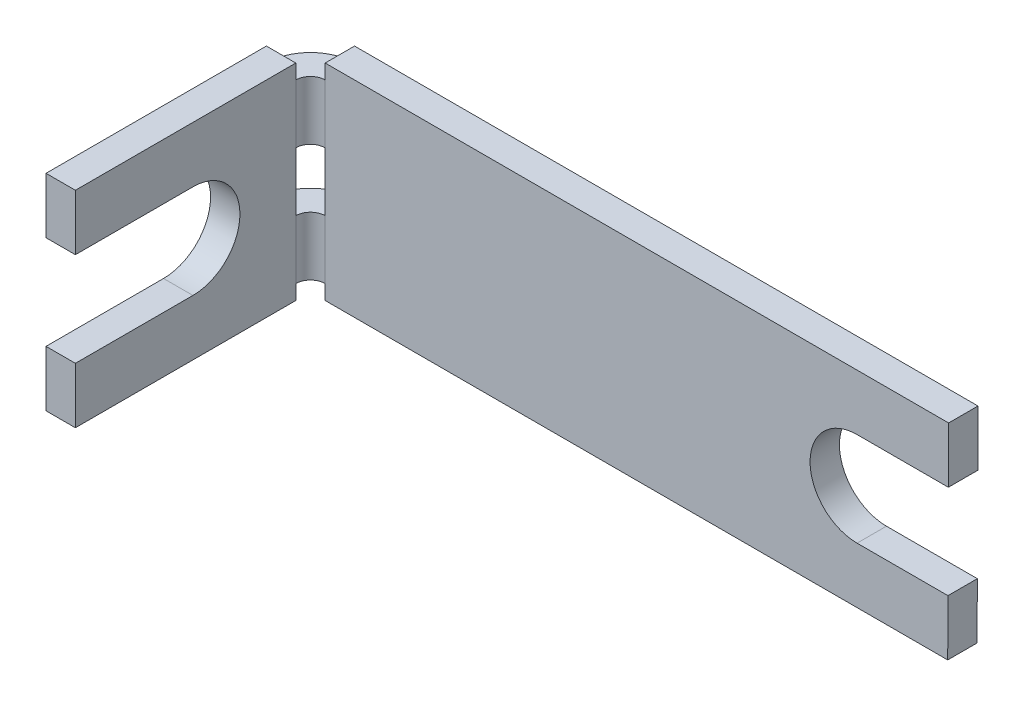
ISO-10303-21;
HEADER;
FILE_DESCRIPTION(('STEP AP214'),'2;1');
FILE_NAME('part.step','',(''),(''),'','','');
FILE_SCHEMA(('AUTOMOTIVE_DESIGN { 1 0 10303 214 1 1 1 1 }'));
ENDSEC;
DATA;
#1=APPLICATION_CONTEXT('core data for automotive mechanical design processes');
#2=APPLICATION_PROTOCOL_DEFINITION('international standard','automotive_design',2000,#1);
#3=PRODUCT_CONTEXT('',#1,'mechanical');
#4=PRODUCT('Part','Part','',(#3));
#5=PRODUCT_RELATED_PRODUCT_CATEGORY('part','',(#4));
#6=PRODUCT_DEFINITION_FORMATION('','',#4);
#7=PRODUCT_DEFINITION_CONTEXT('part definition',#1,'design');
#8=PRODUCT_DEFINITION('design','',#6,#7);
#9=PRODUCT_DEFINITION_SHAPE('','',#8);
#10=(LENGTH_UNIT() NAMED_UNIT(*) SI_UNIT(.MILLI.,.METRE.));
#11=(NAMED_UNIT(*) PLANE_ANGLE_UNIT() SI_UNIT($,.RADIAN.));
#12=(NAMED_UNIT(*) SI_UNIT($,.STERADIAN.) SOLID_ANGLE_UNIT());
#13=UNCERTAINTY_MEASURE_WITH_UNIT(LENGTH_MEASURE(1.E-05),#10,'distance_accuracy_value','');
#14=(GEOMETRIC_REPRESENTATION_CONTEXT(3) GLOBAL_UNCERTAINTY_ASSIGNED_CONTEXT((#13)) GLOBAL_UNIT_ASSIGNED_CONTEXT((#10,
#11,#12)) REPRESENTATION_CONTEXT('',''));
#15=CARTESIAN_POINT('',(0.,0.,0.));
#16=DIRECTION('',(0.,0.,1.));
#17=DIRECTION('',(1.,0.,0.));
#18=AXIS2_PLACEMENT_3D('',#15,#16,#17);
#19=CARTESIAN_POINT('',(-5.39958716632695,-2.47735966736105,0.5));
#20=DIRECTION('',(0.,-1.,0.));
#21=DIRECTION('',(-1.,0.,0.));
#22=AXIS2_PLACEMENT_3D('',#19,#20,#21);
#23=CYLINDRICAL_SURFACE('',#22,1.5);
#24=DIRECTION('',(0.,-1.,0.));
#25=VECTOR('',#24,1.);
#26=CARTESIAN_POINT('',(-5.39958716632695,-2.47735966736105,-1.));
#27=LINE('',#26,#25);
#28=CARTESIAN_POINT('',(-5.39958716632695,-1.97735966736105,-1.));
#29=VERTEX_POINT('',#28);
#30=CARTESIAN_POINT('',(-5.39958716632695,0.0226403326403329,-1.));
#31=VERTEX_POINT('',#30);
#32=EDGE_CURVE('E241',#29,#31,#27,.F.);
#33=ORIENTED_EDGE('',*,*,#32,.F.);
#34=CARTESIAN_POINT('',(-5.39958716632695,-1.97735966736105,0.5));
#35=DIRECTION('',(0.,-1.,0.));
#36=DIRECTION('',(0.,0.,-1.));
#37=AXIS2_PLACEMENT_3D('',#34,#35,#36);
#38=CIRCLE('',#37,1.5);
#39=CARTESIAN_POINT('',(-6.89958716632695,-1.97735966736105,0.499999999999995));
#40=VERTEX_POINT('',#39);
#41=EDGE_CURVE('E335',#29,#40,#38,.F.);
#42=ORIENTED_EDGE('',*,*,#41,.T.);
#43=DIRECTION('',(0.,1.,0.));
#44=VECTOR('',#43,1.);
#45=CARTESIAN_POINT('',(-6.89958716632695,0.,0.499999999999995));
#46=LINE('',#45,#44);
#47=CARTESIAN_POINT('',(-6.89958716632695,0.0226403326403328,0.499999999999995));
#48=VERTEX_POINT('',#47);
#49=EDGE_CURVE('E65',#40,#48,#46,.T.);
#50=ORIENTED_EDGE('',*,*,#49,.T.);
#51=CARTESIAN_POINT('',(-5.39958716632695,0.0226403326403332,0.5));
#52=DIRECTION('',(0.,-1.,0.));
#53=DIRECTION('',(1.,0.,0.));
#54=AXIS2_PLACEMENT_3D('',#51,#52,#53);
#55=CIRCLE('',#54,1.5);
#56=EDGE_CURVE('E418',#31,#48,#55,.F.);
#57=ORIENTED_EDGE('',*,*,#56,.F.);
#58=EDGE_LOOP('',(#33,#42,#50,#57));
#59=FACE_BOUND('',#58,.T.);
#60=ADVANCED_FACE('F42',(#59),#23,.T.);
#61=CARTESIAN_POINT('',(-5.39958716632695,-2.47735966736105,0.5));
#62=DIRECTION('',(0.,-1.,0.));
#63=DIRECTION('',(-1.,0.,0.));
#64=AXIS2_PLACEMENT_3D('',#61,#62,#63);
#65=CYLINDRICAL_SURFACE('',#64,0.500000000000001);
#66=CARTESIAN_POINT('',(-5.39958716632695,-1.97735966736105,0.5));
#67=DIRECTION('',(0.,-1.,0.));
#68=DIRECTION('',(0.,0.,-1.));
#69=AXIS2_PLACEMENT_3D('',#66,#67,#68);
#70=CIRCLE('',#69,0.500000000000001);
#71=CARTESIAN_POINT('',(-5.39958716632695,-1.97735966736105,0.));
#72=VERTEX_POINT('',#71);
#73=CARTESIAN_POINT('',(-5.89958716632695,-1.97735966736105,0.499999999999999));
#74=VERTEX_POINT('',#73);
#75=EDGE_CURVE('E50',#72,#74,#70,.F.);
#76=ORIENTED_EDGE('',*,*,#75,.F.);
#77=DIRECTION('',(0.,-1.,0.));
#78=VECTOR('',#77,1.);
#79=CARTESIAN_POINT('',(-5.39958716632695,-2.47735966736105,0.));
#80=LINE('',#79,#78);
#81=CARTESIAN_POINT('',(-5.39958716632695,0.0226403326403331,0.));
#82=VERTEX_POINT('',#81);
#83=EDGE_CURVE('E245',#72,#82,#80,.F.);
#84=ORIENTED_EDGE('',*,*,#83,.T.);
#85=CARTESIAN_POINT('',(-5.39958716632695,0.0226403326403332,0.5));
#86=DIRECTION('',(0.,-1.,0.));
#87=DIRECTION('',(1.,0.,0.));
#88=AXIS2_PLACEMENT_3D('',#85,#86,#87);
#89=CIRCLE('',#88,0.500000000000001);
#90=CARTESIAN_POINT('',(-5.89958716632695,0.022640332640333,0.499999999999999));
#91=VERTEX_POINT('',#90);
#92=EDGE_CURVE('E297',#82,#91,#89,.F.);
#93=ORIENTED_EDGE('',*,*,#92,.T.);
#94=DIRECTION('',(0.,-1.,0.));
#95=VECTOR('',#94,1.);
#96=CARTESIAN_POINT('',(-5.89958716632695,4.52264033263894,0.499999999999999));
#97=LINE('',#96,#95);
#98=EDGE_CURVE('E331',#91,#74,#97,.T.);
#99=ORIENTED_EDGE('',*,*,#98,.T.);
#100=EDGE_LOOP('',(#76,#84,#93,#99));
#101=FACE_BOUND('',#100,.T.);
#102=ADVANCED_FACE('F337',(#101),#65,.F.);
#103=CARTESIAN_POINT('',(-5.39958716632695,4.02264033263894,0.5));
#104=DIRECTION('',(0.,-1.,0.));
#105=DIRECTION('',(0.,0.,-1.));
#106=AXIS2_PLACEMENT_3D('',#103,#104,#105);
#107=CIRCLE('',#106,1.5);
#108=CARTESIAN_POINT('',(-5.39958716632695,4.02264033263894,-1.));
#109=VERTEX_POINT('',#108);
#110=CARTESIAN_POINT('',(-6.89958716632695,4.02264033263894,0.499999999999995));
#111=VERTEX_POINT('',#110);
#112=EDGE_CURVE('E209',#109,#111,#107,.F.);
#113=ORIENTED_EDGE('',*,*,#112,.F.);
#114=CARTESIAN_POINT('',(-5.39958716632695,2.02264033263756,-1.));
#115=VERTEX_POINT('',#114);
#116=EDGE_CURVE('E231',#115,#109,#27,.F.);
#117=ORIENTED_EDGE('',*,*,#116,.F.);
#118=CARTESIAN_POINT('',(-5.39958716632695,2.02264033263756,0.5));
#119=DIRECTION('',(0.,1.,0.));
#120=DIRECTION('',(-1.,0.,0.));
#121=AXIS2_PLACEMENT_3D('',#118,#119,#120);
#122=CIRCLE('',#121,1.5);
#123=CARTESIAN_POINT('',(-6.89958716632695,2.02264033263756,0.499999999999995));
#124=VERTEX_POINT('',#123);
#125=EDGE_CURVE('E420',#124,#115,#122,.F.);
#126=ORIENTED_EDGE('',*,*,#125,.F.);
#127=EDGE_CURVE('E234',#124,#111,#46,.T.);
#128=ORIENTED_EDGE('',*,*,#127,.T.);
#129=EDGE_LOOP('',(#113,#117,#126,#128));
#130=FACE_BOUND('',#129,.T.);
#131=ADVANCED_FACE('F229',(#130),#23,.T.);
#132=CARTESIAN_POINT('',(-5.39958716632695,2.02264033263756,0.));
#133=VERTEX_POINT('',#132);
#134=CARTESIAN_POINT('',(-5.39958716632695,4.02264033263894,0.));
#135=VERTEX_POINT('',#134);
#136=EDGE_CURVE('E380',#133,#135,#80,.F.);
#137=ORIENTED_EDGE('',*,*,#136,.T.);
#138=CARTESIAN_POINT('',(-5.39958716632695,4.02264033263894,0.5));
#139=DIRECTION('',(0.,-1.,0.));
#140=DIRECTION('',(0.,0.,-1.));
#141=AXIS2_PLACEMENT_3D('',#138,#139,#140);
#142=CIRCLE('',#141,0.500000000000001);
#143=CARTESIAN_POINT('',(-5.89958716632695,4.02264033263894,0.499999999999995));
#144=VERTEX_POINT('',#143);
#145=EDGE_CURVE('E12',#135,#144,#142,.F.);
#146=ORIENTED_EDGE('',*,*,#145,.T.);
#147=CARTESIAN_POINT('',(-5.89958716632695,2.02264033263756,0.499999999999999));
#148=VERTEX_POINT('',#147);
#149=EDGE_CURVE('E342',#144,#148,#97,.T.);
#150=ORIENTED_EDGE('',*,*,#149,.T.);
#151=CARTESIAN_POINT('',(-5.39958716632695,2.02264033263756,0.5));
#152=DIRECTION('',(0.,1.,0.));
#153=DIRECTION('',(-1.,0.,0.));
#154=AXIS2_PLACEMENT_3D('',#151,#152,#153);
#155=CIRCLE('',#154,0.500000000000001);
#156=EDGE_CURVE('E312',#148,#133,#155,.F.);
#157=ORIENTED_EDGE('',*,*,#156,.T.);
#158=EDGE_LOOP('',(#137,#146,#150,#157));
#159=FACE_BOUND('',#158,.T.);
#160=ADVANCED_FACE('F474',(#159),#65,.F.);
#161=CARTESIAN_POINT('',(-6.89958716632698,4.52264033263894,8.));
#162=DIRECTION('',(0.,0.,-1.));
#163=DIRECTION('',(-1.,0.,0.));
#164=AXIS2_PLACEMENT_3D('',#161,#162,#163);
#165=PLANE('',#164);
#166=DIRECTION('',(0.,1.,0.));
#167=VECTOR('',#166,1.);
#168=CARTESIAN_POINT('',(-5.89958716632698,4.52264033263894,8.));
#169=LINE('',#168,#167);
#170=CARTESIAN_POINT('',(-5.89958716632698,-2.47735966736105,8.));
#171=VERTEX_POINT('',#170);
#172=CARTESIAN_POINT('',(-5.89958716632697,-0.577359667359668,8.));
#173=VERTEX_POINT('',#172);
#174=EDGE_CURVE('E364',#171,#173,#169,.T.);
#175=ORIENTED_EDGE('',*,*,#174,.T.);
#176=DIRECTION('',(-1.,0.,0.));
#177=VECTOR('',#176,1.);
#178=CARTESIAN_POINT('',(0.550219032309287,-0.577359667359668,8.00000000000003));
#179=LINE('',#178,#177);
#180=CARTESIAN_POINT('',(-6.89958716632698,-0.577359667359668,8.));
#181=VERTEX_POINT('',#180);
#182=EDGE_CURVE('E433',#173,#181,#179,.T.);
#183=ORIENTED_EDGE('',*,*,#182,.T.);
#184=DIRECTION('',(0.,1.,0.));
#185=VECTOR('',#184,1.);
#186=CARTESIAN_POINT('',(-6.89958716632698,4.52264033263894,8.));
#187=LINE('',#186,#185);
#188=CARTESIAN_POINT('',(-6.89958716632698,-2.47735966736105,8.));
#189=VERTEX_POINT('',#188);
#190=EDGE_CURVE('E367',#189,#181,#187,.T.);
#191=ORIENTED_EDGE('',*,*,#190,.F.);
#192=DIRECTION('',(1.,0.,0.));
#193=VECTOR('',#192,1.);
#194=CARTESIAN_POINT('',(-6.89958716632698,-2.47735966736105,8.));
#195=LINE('',#194,#193);
#196=EDGE_CURVE('E378',#189,#171,#195,.T.);
#197=ORIENTED_EDGE('',*,*,#196,.T.);
#198=EDGE_LOOP('',(#175,#183,#191,#197));
#199=FACE_BOUND('',#198,.T.);
#200=ADVANCED_FACE('F457',(#199),#165,.F.);
#201=CARTESIAN_POINT('',(-5.89958716632695,-2.47735966736105,-1.));
#202=DIRECTION('',(0.,-1.,0.));
#203=DIRECTION('',(1.,0.,0.));
#204=AXIS2_PLACEMENT_3D('',#201,#202,#203);
#205=PLANE('',#204);
#206=DIRECTION('',(1.,0.,0.));
#207=VECTOR('',#206,1.);
#208=CARTESIAN_POINT('',(-5.89958716632695,-2.47735966736105,0.));
#209=LINE('',#208,#207);
#210=CARTESIAN_POINT('',(-5.39958716632695,-2.47735966736105,0.));
#211=VERTEX_POINT('',#210);
#212=CARTESIAN_POINT('',(15.7849810224966,-2.47735966736105,0.));
#213=VERTEX_POINT('',#212);
#214=EDGE_CURVE('E279',#211,#213,#209,.T.);
#215=ORIENTED_EDGE('',*,*,#214,.F.);
#216=DIRECTION('',(0.,0.,-1.));
#217=VECTOR('',#216,1.);
#218=CARTESIAN_POINT('',(-5.39958716632695,-2.47735966736105,0.));
#219=LINE('',#218,#217);
#220=CARTESIAN_POINT('',(-5.39958716632695,-2.47735966736105,-1.));
#221=VERTEX_POINT('',#220);
#222=EDGE_CURVE('E249',#211,#221,#219,.T.);
#223=ORIENTED_EDGE('',*,*,#222,.T.);
#224=DIRECTION('',(1.,0.,0.));
#225=VECTOR('',#224,1.);
#226=CARTESIAN_POINT('',(-5.89958716632695,-2.47735966736105,-1.));
#227=LINE('',#226,#225);
#228=CARTESIAN_POINT('',(15.7849810224966,-2.47735966736105,-1.));
#229=VERTEX_POINT('',#228);
#230=EDGE_CURVE('E260',#221,#229,#227,.T.);
#231=ORIENTED_EDGE('',*,*,#230,.T.);
#232=DIRECTION('',(0.,0.,1.));
#233=VECTOR('',#232,1.);
#234=CARTESIAN_POINT('',(15.7849810224966,-2.47735966736105,-1.));
#235=LINE('',#234,#233);
#236=EDGE_CURVE('E276',#229,#213,#235,.T.);
#237=ORIENTED_EDGE('',*,*,#236,.T.);
#238=EDGE_LOOP('',(#215,#223,#231,#237));
#239=FACE_BOUND('',#238,.T.);
#240=ADVANCED_FACE('F504',(#239),#205,.T.);
#241=CARTESIAN_POINT('',(12.700412833673,1.02264033263855,-1.));
#242=DIRECTION('',(0.,0.,1.));
#243=DIRECTION('',(1.,0.,0.));
#244=AXIS2_PLACEMENT_3D('',#241,#242,#243);
#245=PLANE('',#244);
#246=EDGE_CURVE('E244',#221,#29,#27,.F.);
#247=ORIENTED_EDGE('',*,*,#246,.T.);
#248=ORIENTED_EDGE('',*,*,#32,.T.);
#249=DIRECTION('',(0.,-1.,0.));
#250=VECTOR('',#249,1.);
#251=CARTESIAN_POINT('',(-5.39958716632695,-2.47735966736105,-1.));
#252=LINE('',#251,#250);
#253=EDGE_CURVE('E240',#115,#31,#252,.T.);
#254=ORIENTED_EDGE('',*,*,#253,.F.);
#255=ORIENTED_EDGE('',*,*,#116,.T.);
#256=DIRECTION('',(0.,1.,0.));
#257=VECTOR('',#256,1.);
#258=CARTESIAN_POINT('',(-5.39958716632695,4.02264033263894,-1.));
#259=LINE('',#258,#257);
#260=CARTESIAN_POINT('',(-5.39958716632695,4.52264033263894,-1.));
#261=VERTEX_POINT('',#260);
#262=EDGE_CURVE('E213',#109,#261,#259,.T.);
#263=ORIENTED_EDGE('',*,*,#262,.T.);
#264=DIRECTION('',(-1.,0.,0.));
#265=VECTOR('',#264,1.);
#266=CARTESIAN_POINT('',(15.815868594768,4.52264033263895,-1.));
#267=LINE('',#266,#265);
#268=CARTESIAN_POINT('',(15.815868594768,4.52264033263895,-1.));
#269=VERTEX_POINT('',#268);
#270=EDGE_CURVE('E258',#269,#261,#267,.T.);
#271=ORIENTED_EDGE('',*,*,#270,.F.);
#272=DIRECTION('',(0.00441246736877614,0.999990265018475,0.));
#273=VECTOR('',#272,1.);
#274=CARTESIAN_POINT('',(15.8074848251515,2.62264033263815,-1.));
#275=LINE('',#274,#273);
#276=CARTESIAN_POINT('',(15.8074848251515,2.62264033263815,-1.));
#277=VERTEX_POINT('',#276);
#278=EDGE_CURVE('E273',#277,#269,#275,.T.);
#279=ORIENTED_EDGE('',*,*,#278,.F.);
#280=DIRECTION('',(1.,0.,0.));
#281=VECTOR('',#280,1.);
#282=CARTESIAN_POINT('',(13.620412833673,2.62264033263815,-1.));
#283=LINE('',#282,#281);
#284=CARTESIAN_POINT('',(12.700412833673,2.62264033263815,-1.));
#285=VERTEX_POINT('',#284);
#286=EDGE_CURVE('E271',#285,#277,#283,.T.);
#287=ORIENTED_EDGE('',*,*,#286,.F.);
#288=CARTESIAN_POINT('',(12.700412833673,1.02264033263855,-1.));
#289=DIRECTION('',(0.,0.,-1.));
#290=DIRECTION('',(1.,0.,0.));
#291=AXIS2_PLACEMENT_3D('',#288,#289,#290);
#292=CIRCLE('',#291,1.5999999999996);
#293=CARTESIAN_POINT('',(12.700412833673,-0.577359667361056,-1.));
#294=VERTEX_POINT('',#293);
#295=EDGE_CURVE('E268',#294,#285,#292,.T.);
#296=ORIENTED_EDGE('',*,*,#295,.F.);
#297=DIRECTION('',(-1.,0.,0.));
#298=VECTOR('',#297,1.);
#299=CARTESIAN_POINT('',(13.620412833673,-0.577359667361056,-1.));
#300=LINE('',#299,#298);
#301=CARTESIAN_POINT('',(15.7933647921131,-0.577359667361056,-1.));
#302=VERTEX_POINT('',#301);
#303=EDGE_CURVE('E266',#302,#294,#300,.T.);
#304=ORIENTED_EDGE('',*,*,#303,.F.);
#305=DIRECTION('',(0.00441246736877982,0.999990265018475,0.));
#306=VECTOR('',#305,1.);
#307=CARTESIAN_POINT('',(15.7849810224966,-2.47735966736105,-1.));
#308=LINE('',#307,#306);
#309=EDGE_CURVE('E263',#229,#302,#308,.T.);
#310=ORIENTED_EDGE('',*,*,#309,.F.);
#311=ORIENTED_EDGE('',*,*,#230,.F.);
#312=EDGE_LOOP('',(#247,#248,#254,#255,#263,#271,#279,#287,#296,#304,#310,#311));
#313=FACE_BOUND('',#312,.T.);
#314=ADVANCED_FACE('F238',(#313),#245,.F.);
#315=CARTESIAN_POINT('',(12.700412833673,1.02264033263855,0.));
#316=DIRECTION('',(0.,0.,1.));
#317=DIRECTION('',(1.,0.,0.));
#318=AXIS2_PLACEMENT_3D('',#315,#316,#317);
#319=PLANE('',#318);
#320=DIRECTION('',(-1.,0.,0.));
#321=VECTOR('',#320,1.);
#322=CARTESIAN_POINT('',(15.815868594768,4.52264033263895,0.));
#323=LINE('',#322,#321);
#324=CARTESIAN_POINT('',(15.815868594768,4.52264033263895,0.));
#325=VERTEX_POINT('',#324);
#326=CARTESIAN_POINT('',(-5.39958716632695,4.52264033263894,0.));
#327=VERTEX_POINT('',#326);
#328=EDGE_CURVE('E255',#325,#327,#323,.T.);
#329=ORIENTED_EDGE('',*,*,#328,.T.);
#330=DIRECTION('',(0.,1.,0.));
#331=VECTOR('',#330,1.);
#332=CARTESIAN_POINT('',(-5.39958716632695,1.02264033263855,0.));
#333=LINE('',#332,#331);
#334=EDGE_CURVE('E235',#135,#327,#333,.T.);
#335=ORIENTED_EDGE('',*,*,#334,.F.);
#336=ORIENTED_EDGE('',*,*,#136,.F.);
#337=EDGE_CURVE('E247',#82,#133,#80,.F.);
#338=ORIENTED_EDGE('',*,*,#337,.F.);
#339=ORIENTED_EDGE('',*,*,#83,.F.);
#340=EDGE_CURVE('E242',#211,#72,#80,.F.);
#341=ORIENTED_EDGE('',*,*,#340,.F.);
#342=ORIENTED_EDGE('',*,*,#214,.T.);
#343=DIRECTION('',(0.00441246736877982,0.999990265018475,0.));
#344=VECTOR('',#343,1.);
#345=CARTESIAN_POINT('',(15.7849810224966,-2.47735966736105,0.));
#346=LINE('',#345,#344);
#347=CARTESIAN_POINT('',(15.7933647921131,-0.577359667361056,0.));
#348=VERTEX_POINT('',#347);
#349=EDGE_CURVE('E281',#213,#348,#346,.T.);
#350=ORIENTED_EDGE('',*,*,#349,.T.);
#351=DIRECTION('',(-1.,0.,0.));
#352=VECTOR('',#351,1.);
#353=CARTESIAN_POINT('',(13.620412833673,-0.577359667361056,0.));
#354=LINE('',#353,#352);
#355=CARTESIAN_POINT('',(12.700412833673,-0.577359667361056,0.));
#356=VERTEX_POINT('',#355);
#357=EDGE_CURVE('E284',#348,#356,#354,.T.);
#358=ORIENTED_EDGE('',*,*,#357,.T.);
#359=CARTESIAN_POINT('',(12.700412833673,1.02264033263855,0.));
#360=DIRECTION('',(0.,0.,-1.));
#361=DIRECTION('',(1.,0.,0.));
#362=AXIS2_PLACEMENT_3D('',#359,#360,#361);
#363=CIRCLE('',#362,1.5999999999996);
#364=CARTESIAN_POINT('',(12.700412833673,2.62264033263815,0.));
#365=VERTEX_POINT('',#364);
#366=EDGE_CURVE('E287',#356,#365,#363,.T.);
#367=ORIENTED_EDGE('',*,*,#366,.T.);
#368=DIRECTION('',(1.,0.,0.));
#369=VECTOR('',#368,1.);
#370=CARTESIAN_POINT('',(13.620412833673,2.62264033263815,0.));
#371=LINE('',#370,#369);
#372=CARTESIAN_POINT('',(15.8074848251515,2.62264033263815,0.));
#373=VERTEX_POINT('',#372);
#374=EDGE_CURVE('E290',#365,#373,#371,.T.);
#375=ORIENTED_EDGE('',*,*,#374,.T.);
#376=DIRECTION('',(0.00441246736877614,0.999990265018475,0.));
#377=VECTOR('',#376,1.);
#378=CARTESIAN_POINT('',(15.8074848251515,2.62264033263815,0.));
#379=LINE('',#378,#377);
#380=EDGE_CURVE('E261',#373,#325,#379,.T.);
#381=ORIENTED_EDGE('',*,*,#380,.T.);
#382=EDGE_LOOP('',(#329,#335,#336,#338,#339,#341,#342,#350,#358,#367,#375,#381));
#383=FACE_BOUND('',#382,.T.);
#384=ADVANCED_FACE('F403',(#383),#319,.T.);
#385=CARTESIAN_POINT('',(15.815868594768,4.52264033263895,-1.));
#386=DIRECTION('',(0.,1.,0.));
#387=DIRECTION('',(-1.,0.,0.));
#388=AXIS2_PLACEMENT_3D('',#385,#386,#387);
#389=PLANE('',#388);
#390=DIRECTION('',(0.,0.,-1.));
#391=VECTOR('',#390,1.);
#392=CARTESIAN_POINT('',(-5.39958716632695,4.52264033263894,0.));
#393=LINE('',#392,#391);
#394=EDGE_CURVE('E219',#327,#261,#393,.T.);
#395=ORIENTED_EDGE('',*,*,#394,.F.);
#396=ORIENTED_EDGE('',*,*,#328,.F.);
#397=DIRECTION('',(0.,0.,1.));
#398=VECTOR('',#397,1.);
#399=CARTESIAN_POINT('',(15.815868594768,4.52264033263895,-1.));
#400=LINE('',#399,#398);
#401=EDGE_CURVE('E295',#269,#325,#400,.T.);
#402=ORIENTED_EDGE('',*,*,#401,.F.);
#403=ORIENTED_EDGE('',*,*,#270,.T.);
#404=EDGE_LOOP('',(#395,#396,#402,#403));
#405=FACE_BOUND('',#404,.T.);
#406=ADVANCED_FACE('F44',(#405),#389,.T.);
#407=CARTESIAN_POINT('',(15.8074848251515,2.62264033263815,-1.));
#408=DIRECTION('',(0.999990265018475,-0.00441246736877614,0.));
#409=DIRECTION('',(0.00441246736877614,0.999990265018475,0.));
#410=AXIS2_PLACEMENT_3D('',#407,#408,#409);
#411=PLANE('',#410);
#412=ORIENTED_EDGE('',*,*,#380,.F.);
#413=DIRECTION('',(0.,0.,1.));
#414=VECTOR('',#413,1.);
#415=CARTESIAN_POINT('',(15.8074848251515,2.62264033263815,-1.));
#416=LINE('',#415,#414);
#417=EDGE_CURVE('E298',#277,#373,#416,.T.);
#418=ORIENTED_EDGE('',*,*,#417,.F.);
#419=ORIENTED_EDGE('',*,*,#278,.T.);
#420=ORIENTED_EDGE('',*,*,#401,.T.);
#421=EDGE_LOOP('',(#412,#418,#419,#420));
#422=FACE_BOUND('',#421,.T.);
#423=ADVANCED_FACE('F511',(#422),#411,.T.);
#424=CARTESIAN_POINT('',(13.620412833673,2.62264033263815,-1.));
#425=DIRECTION('',(0.,-1.,0.));
#426=DIRECTION('',(0.,0.,-1.));
#427=AXIS2_PLACEMENT_3D('',#424,#425,#426);
#428=PLANE('',#427);
#429=ORIENTED_EDGE('',*,*,#374,.F.);
#430=DIRECTION('',(0.,0.,1.));
#431=VECTOR('',#430,1.);
#432=CARTESIAN_POINT('',(12.700412833673,2.62264033263815,-1.));
#433=LINE('',#432,#431);
#434=EDGE_CURVE('E300',#285,#365,#433,.T.);
#435=ORIENTED_EDGE('',*,*,#434,.F.);
#436=ORIENTED_EDGE('',*,*,#286,.T.);
#437=ORIENTED_EDGE('',*,*,#417,.T.);
#438=EDGE_LOOP('',(#429,#435,#436,#437));
#439=FACE_BOUND('',#438,.T.);
#440=ADVANCED_FACE('F514',(#439),#428,.T.);
#441=CARTESIAN_POINT('',(12.700412833673,1.02264033263855,-1.));
#442=DIRECTION('',(0.,0.,1.));
#443=DIRECTION('',(1.,0.,0.));
#444=AXIS2_PLACEMENT_3D('',#441,#442,#443);
#445=CYLINDRICAL_SURFACE('',#444,1.5999999999996);
#446=ORIENTED_EDGE('',*,*,#366,.F.);
#447=DIRECTION('',(0.,0.,1.));
#448=VECTOR('',#447,1.);
#449=CARTESIAN_POINT('',(12.700412833673,-0.577359667361056,-1.));
#450=LINE('',#449,#448);
#451=EDGE_CURVE('E303',#294,#356,#450,.T.);
#452=ORIENTED_EDGE('',*,*,#451,.F.);
#453=ORIENTED_EDGE('',*,*,#295,.T.);
#454=ORIENTED_EDGE('',*,*,#434,.T.);
#455=EDGE_LOOP('',(#446,#452,#453,#454));
#456=FACE_BOUND('',#455,.T.);
#457=ADVANCED_FACE('F518',(#456),#445,.F.);
#458=CARTESIAN_POINT('',(13.620412833673,-0.577359667361056,-1.));
#459=DIRECTION('',(0.,1.,0.));
#460=DIRECTION('',(-1.,0.,0.));
#461=AXIS2_PLACEMENT_3D('',#458,#459,#460);
#462=PLANE('',#461);
#463=ORIENTED_EDGE('',*,*,#357,.F.);
#464=DIRECTION('',(0.,0.,1.));
#465=VECTOR('',#464,1.);
#466=CARTESIAN_POINT('',(15.7933647921131,-0.577359667361056,-1.));
#467=LINE('',#466,#465);
#468=EDGE_CURVE('E305',#302,#348,#467,.T.);
#469=ORIENTED_EDGE('',*,*,#468,.F.);
#470=ORIENTED_EDGE('',*,*,#303,.T.);
#471=ORIENTED_EDGE('',*,*,#451,.T.);
#472=EDGE_LOOP('',(#463,#469,#470,#471));
#473=FACE_BOUND('',#472,.T.);
#474=ADVANCED_FACE('F522',(#473),#462,.T.);
#475=CARTESIAN_POINT('',(15.7849810224966,-2.47735966736105,-1.));
#476=DIRECTION('',(0.999990265018475,-0.00441246736877982,0.));
#477=DIRECTION('',(0.00441246736877982,0.999990265018475,0.));
#478=AXIS2_PLACEMENT_3D('',#475,#476,#477);
#479=PLANE('',#478);
#480=ORIENTED_EDGE('',*,*,#349,.F.);
#481=ORIENTED_EDGE('',*,*,#236,.F.);
#482=ORIENTED_EDGE('',*,*,#309,.T.);
#483=ORIENTED_EDGE('',*,*,#468,.T.);
#484=EDGE_LOOP('',(#480,#481,#482,#483));
#485=FACE_BOUND('',#484,.T.);
#486=ADVANCED_FACE('F526',(#485),#479,.T.);
#487=CARTESIAN_POINT('',(-6.89958716632695,4.52264033263894,0.));
#488=DIRECTION('',(0.,-1.,0.));
#489=DIRECTION('',(1.,0.,0.));
#490=AXIS2_PLACEMENT_3D('',#487,#488,#489);
#491=PLANE('',#490);
#492=DIRECTION('',(-1.,0.,0.));
#493=VECTOR('',#492,1.);
#494=CARTESIAN_POINT('',(-5.89958716632695,4.52264033263894,0.499999999999999));
#495=LINE('',#494,#493);
#496=CARTESIAN_POINT('',(-5.89958716632695,4.52264033263894,0.499999999999999));
#497=VERTEX_POINT('',#496);
#498=CARTESIAN_POINT('',(-6.89958716632695,4.52264033263894,0.499999999999995));
#499=VERTEX_POINT('',#498);
#500=EDGE_CURVE('E340',#497,#499,#495,.T.);
#501=ORIENTED_EDGE('',*,*,#500,.T.);
#502=DIRECTION('',(0.,0.,-1.));
#503=VECTOR('',#502,1.);
#504=CARTESIAN_POINT('',(-6.89958716632695,4.52264033263894,0.));
#505=LINE('',#504,#503);
#506=CARTESIAN_POINT('',(-6.89958716632698,4.52264033263894,8.));
#507=VERTEX_POINT('',#506);
#508=EDGE_CURVE('E360',#507,#499,#505,.T.);
#509=ORIENTED_EDGE('',*,*,#508,.F.);
#510=DIRECTION('',(1.,0.,0.));
#511=VECTOR('',#510,1.);
#512=CARTESIAN_POINT('',(-6.89958716632698,4.52264033263894,8.));
#513=LINE('',#512,#511);
#514=CARTESIAN_POINT('',(-5.89958716632698,4.52264033263894,8.));
#515=VERTEX_POINT('',#514);
#516=EDGE_CURVE('E370',#507,#515,#513,.T.);
#517=ORIENTED_EDGE('',*,*,#516,.T.);
#518=DIRECTION('',(0.,0.,-1.));
#519=VECTOR('',#518,1.);
#520=CARTESIAN_POINT('',(-5.89958716632695,4.52264033263894,0.));
#521=LINE('',#520,#519);
#522=EDGE_CURVE('E359',#515,#497,#521,.T.);
#523=ORIENTED_EDGE('',*,*,#522,.T.);
#524=EDGE_LOOP('',(#501,#509,#517,#523));
#525=FACE_BOUND('',#524,.T.);
#526=ADVANCED_FACE('F469',(#525),#491,.F.);
#527=CARTESIAN_POINT('',(-6.89958716632698,-2.47735966736105,8.));
#528=DIRECTION('',(0.,1.,0.));
#529=DIRECTION('',(-1.,0.,0.));
#530=AXIS2_PLACEMENT_3D('',#527,#528,#529);
#531=PLANE('',#530);
#532=DIRECTION('',(-1.,0.,0.));
#533=VECTOR('',#532,1.);
#534=CARTESIAN_POINT('',(-5.89958716632695,-2.47735966736105,0.499999999999999));
#535=LINE('',#534,#533);
#536=CARTESIAN_POINT('',(-5.89958716632695,-2.47735966736105,0.499999999999999));
#537=VERTEX_POINT('',#536);
#538=CARTESIAN_POINT('',(-6.89958716632695,-2.47735966736105,0.499999999999995));
#539=VERTEX_POINT('',#538);
#540=EDGE_CURVE('E352',#537,#539,#535,.T.);
#541=ORIENTED_EDGE('',*,*,#540,.F.);
#542=DIRECTION('',(0.,0.,1.));
#543=VECTOR('',#542,1.);
#544=CARTESIAN_POINT('',(-5.89958716632698,-2.47735966736105,8.));
#545=LINE('',#544,#543);
#546=EDGE_CURVE('E333',#537,#171,#545,.T.);
#547=ORIENTED_EDGE('',*,*,#546,.T.);
#548=ORIENTED_EDGE('',*,*,#196,.F.);
#549=DIRECTION('',(0.,0.,1.));
#550=VECTOR('',#549,1.);
#551=CARTESIAN_POINT('',(-6.89958716632698,-2.47735966736105,8.));
#552=LINE('',#551,#550);
#553=EDGE_CURVE('E363',#539,#189,#552,.T.);
#554=ORIENTED_EDGE('',*,*,#553,.F.);
#555=EDGE_LOOP('',(#541,#547,#548,#554));
#556=FACE_BOUND('',#555,.T.);
#557=ADVANCED_FACE('F579',(#556),#531,.F.);
#558=CARTESIAN_POINT('',(-6.89958716632695,0.,0.));
#559=DIRECTION('',(1.,0.,0.));
#560=DIRECTION('',(0.,0.,-1.));
#561=AXIS2_PLACEMENT_3D('',#558,#559,#560);
#562=PLANE('',#561);
#563=ORIENTED_EDGE('',*,*,#190,.T.);
#564=DIRECTION('',(0.,0.,1.));
#565=VECTOR('',#564,1.);
#566=CARTESIAN_POINT('',(-6.89958716632697,-0.577359667359668,4.));
#567=LINE('',#566,#565);
#568=CARTESIAN_POINT('',(-6.89958716632697,-0.577359667359668,4.));
#569=VERTEX_POINT('',#568);
#570=EDGE_CURVE('E428',#569,#181,#567,.T.);
#571=ORIENTED_EDGE('',*,*,#570,.F.);
#572=CARTESIAN_POINT('',(-6.89958716632697,1.02264033263895,4.));
#573=DIRECTION('',(-1.,0.,0.));
#574=DIRECTION('',(0.,0.,1.));
#575=AXIS2_PLACEMENT_3D('',#572,#573,#574);
#576=CIRCLE('',#575,1.59999999999861);
#577=CARTESIAN_POINT('',(-6.89958716632697,2.62264033263756,4.));
#578=VERTEX_POINT('',#577);
#579=EDGE_CURVE('E423',#578,#569,#576,.T.);
#580=ORIENTED_EDGE('',*,*,#579,.F.);
#581=DIRECTION('',(0.,0.,-1.));
#582=VECTOR('',#581,1.);
#583=CARTESIAN_POINT('',(-6.89958716632697,2.62264033263756,4.));
#584=LINE('',#583,#582);
#585=CARTESIAN_POINT('',(-6.89958716632698,2.62264033263756,8.));
#586=VERTEX_POINT('',#585);
#587=EDGE_CURVE('E424',#586,#578,#584,.T.);
#588=ORIENTED_EDGE('',*,*,#587,.F.);
#589=EDGE_CURVE('E366',#586,#507,#187,.T.);
#590=ORIENTED_EDGE('',*,*,#589,.T.);
#591=ORIENTED_EDGE('',*,*,#508,.T.);
#592=DIRECTION('',(0.,1.,0.));
#593=VECTOR('',#592,1.);
#594=CARTESIAN_POINT('',(-6.89958716632695,4.02264033263894,0.499999999999995));
#595=LINE('',#594,#593);
#596=EDGE_CURVE('E224',#111,#499,#595,.T.);
#597=ORIENTED_EDGE('',*,*,#596,.F.);
#598=ORIENTED_EDGE('',*,*,#127,.F.);
#599=DIRECTION('',(0.,1.,0.));
#600=VECTOR('',#599,1.);
#601=CARTESIAN_POINT('',(-6.89958716632695,2.02264033263756,0.499999999999995));
#602=LINE('',#601,#600);
#603=EDGE_CURVE('E411',#48,#124,#602,.T.);
#604=ORIENTED_EDGE('',*,*,#603,.F.);
#605=ORIENTED_EDGE('',*,*,#49,.F.);
#606=EDGE_CURVE('E357',#539,#40,#46,.T.);
#607=ORIENTED_EDGE('',*,*,#606,.F.);
#608=ORIENTED_EDGE('',*,*,#553,.T.);
#609=EDGE_LOOP('',(#563,#571,#580,#588,#590,#591,#597,#598,#604,#605,#607,#608));
#610=FACE_BOUND('',#609,.T.);
#611=ADVANCED_FACE('F455',(#610),#562,.F.);
#612=CARTESIAN_POINT('',(-5.89958716632695,0.,0.));
#613=DIRECTION('',(1.,0.,0.));
#614=DIRECTION('',(0.,0.,-1.));
#615=AXIS2_PLACEMENT_3D('',#612,#613,#614);
#616=PLANE('',#615);
#617=DIRECTION('',(0.,0.,1.));
#618=VECTOR('',#617,1.);
#619=CARTESIAN_POINT('',(-5.89958716632697,-0.577359667359668,4.));
#620=LINE('',#619,#618);
#621=CARTESIAN_POINT('',(-5.89958716632697,-0.577359667359668,4.));
#622=VERTEX_POINT('',#621);
#623=EDGE_CURVE('E427',#622,#173,#620,.T.);
#624=ORIENTED_EDGE('',*,*,#623,.T.);
#625=ORIENTED_EDGE('',*,*,#174,.F.);
#626=ORIENTED_EDGE('',*,*,#546,.F.);
#627=DIRECTION('',(0.,-1.,0.));
#628=VECTOR('',#627,1.);
#629=CARTESIAN_POINT('',(-5.89958716632695,-1.97735966736105,0.499999999999999));
#630=LINE('',#629,#628);
#631=EDGE_CURVE('E327',#74,#537,#630,.T.);
#632=ORIENTED_EDGE('',*,*,#631,.F.);
#633=ORIENTED_EDGE('',*,*,#98,.F.);
#634=EDGE_CURVE('E339',#148,#91,#97,.T.);
#635=ORIENTED_EDGE('',*,*,#634,.F.);
#636=ORIENTED_EDGE('',*,*,#149,.F.);
#637=EDGE_CURVE('E343',#497,#144,#97,.T.);
#638=ORIENTED_EDGE('',*,*,#637,.F.);
#639=ORIENTED_EDGE('',*,*,#522,.F.);
#640=CARTESIAN_POINT('',(-5.89958716632698,2.62264033263756,8.));
#641=VERTEX_POINT('',#640);
#642=EDGE_CURVE('E374',#641,#515,#169,.T.);
#643=ORIENTED_EDGE('',*,*,#642,.F.);
#644=DIRECTION('',(0.,0.,-1.));
#645=VECTOR('',#644,1.);
#646=CARTESIAN_POINT('',(-5.89958716632697,2.62264033263756,4.));
#647=LINE('',#646,#645);
#648=CARTESIAN_POINT('',(-5.89958716632697,2.62264033263756,4.));
#649=VERTEX_POINT('',#648);
#650=EDGE_CURVE('E438',#641,#649,#647,.T.);
#651=ORIENTED_EDGE('',*,*,#650,.T.);
#652=CARTESIAN_POINT('',(-5.89958716632697,1.02264033263895,4.));
#653=DIRECTION('',(1.,0.,0.));
#654=DIRECTION('',(0.,0.,-1.));
#655=AXIS2_PLACEMENT_3D('',#652,#653,#654);
#656=CIRCLE('',#655,1.59999999999861);
#657=EDGE_CURVE('E434',#649,#622,#656,.F.);
#658=ORIENTED_EDGE('',*,*,#657,.T.);
#659=EDGE_LOOP('',(#624,#625,#626,#632,#633,#635,#636,#638,#639,#643,#651,#658));
#660=FACE_BOUND('',#659,.T.);
#661=ADVANCED_FACE('F329',(#660),#616,.T.);
#662=ORIENTED_EDGE('',*,*,#589,.F.);
#663=DIRECTION('',(-1.,0.,0.));
#664=VECTOR('',#663,1.);
#665=CARTESIAN_POINT('',(0.550219032309287,2.62264033263756,8.00000000000003));
#666=LINE('',#665,#664);
#667=EDGE_CURVE('E441',#641,#586,#666,.T.);
#668=ORIENTED_EDGE('',*,*,#667,.F.);
#669=ORIENTED_EDGE('',*,*,#642,.T.);
#670=ORIENTED_EDGE('',*,*,#516,.F.);
#671=EDGE_LOOP('',(#662,#668,#669,#670));
#672=FACE_BOUND('',#671,.T.);
#673=ADVANCED_FACE('F465',(#672),#165,.F.);
#674=CARTESIAN_POINT('',(0.5502190323093,-0.577359667359668,4.00000000000002));
#675=DIRECTION('',(0.,-1.,0.));
#676=DIRECTION('',(0.,0.,-1.));
#677=AXIS2_PLACEMENT_3D('',#674,#675,#676);
#678=PLANE('',#677);
#679=DIRECTION('',(-1.,0.,0.));
#680=VECTOR('',#679,1.);
#681=CARTESIAN_POINT('',(0.5502190323093,-0.577359667359668,4.00000000000002));
#682=LINE('',#681,#680);
#683=EDGE_CURVE('E345',#622,#569,#682,.T.);
#684=ORIENTED_EDGE('',*,*,#683,.T.);
#685=ORIENTED_EDGE('',*,*,#570,.T.);
#686=ORIENTED_EDGE('',*,*,#182,.F.);
#687=ORIENTED_EDGE('',*,*,#623,.F.);
#688=EDGE_LOOP('',(#684,#685,#686,#687));
#689=FACE_BOUND('',#688,.T.);
#690=ADVANCED_FACE('F447',(#689),#678,.F.);
#691=CARTESIAN_POINT('',(0.5502190323093,2.62264033263756,4.00000000000002));
#692=DIRECTION('',(0.,1.,0.));
#693=DIRECTION('',(0.,0.,1.));
#694=AXIS2_PLACEMENT_3D('',#691,#692,#693);
#695=PLANE('',#694);
#696=ORIENTED_EDGE('',*,*,#667,.T.);
#697=ORIENTED_EDGE('',*,*,#587,.T.);
#698=DIRECTION('',(-1.,0.,0.));
#699=VECTOR('',#698,1.);
#700=CARTESIAN_POINT('',(0.5502190323093,2.62264033263756,4.00000000000002));
#701=LINE('',#700,#699);
#702=EDGE_CURVE('E437',#649,#578,#701,.T.);
#703=ORIENTED_EDGE('',*,*,#702,.F.);
#704=ORIENTED_EDGE('',*,*,#650,.F.);
#705=EDGE_LOOP('',(#696,#697,#703,#704));
#706=FACE_BOUND('',#705,.T.);
#707=ADVANCED_FACE('F460',(#706),#695,.F.);
#708=CARTESIAN_POINT('',(0.5502190323093,1.02264033263895,4.00000000000002));
#709=DIRECTION('',(-1.,0.,0.));
#710=DIRECTION('',(0.,0.,1.));
#711=AXIS2_PLACEMENT_3D('',#708,#709,#710);
#712=CYLINDRICAL_SURFACE('',#711,1.59999999999861);
#713=ORIENTED_EDGE('',*,*,#702,.T.);
#714=ORIENTED_EDGE('',*,*,#579,.T.);
#715=ORIENTED_EDGE('',*,*,#683,.F.);
#716=ORIENTED_EDGE('',*,*,#657,.F.);
#717=EDGE_LOOP('',(#713,#714,#715,#716));
#718=FACE_BOUND('',#717,.T.);
#719=ADVANCED_FACE('F451',(#718),#712,.F.);
#720=CARTESIAN_POINT('',(-5.39958716632695,0.,0.));
#721=DIRECTION('',(1.,0.,0.));
#722=DIRECTION('',(0.,0.,-1.));
#723=AXIS2_PLACEMENT_3D('',#720,#721,#722);
#724=PLANE('',#723);
#725=ORIENTED_EDGE('',*,*,#253,.T.);
#726=DIRECTION('',(0.,0.,1.));
#727=VECTOR('',#726,1.);
#728=CARTESIAN_POINT('',(-5.39958716632695,0.0226403326403332,0.500000000000031));
#729=LINE('',#728,#727);
#730=EDGE_CURVE('E395',#31,#82,#729,.T.);
#731=ORIENTED_EDGE('',*,*,#730,.T.);
#732=ORIENTED_EDGE('',*,*,#337,.T.);
#733=DIRECTION('',(0.,0.,-1.));
#734=VECTOR('',#733,1.);
#735=CARTESIAN_POINT('',(-5.39958716632695,2.02264033263756,0.500000000000031));
#736=LINE('',#735,#734);
#737=EDGE_CURVE('E401',#133,#115,#736,.T.);
#738=ORIENTED_EDGE('',*,*,#737,.T.);
#739=EDGE_LOOP('',(#725,#731,#732,#738));
#740=FACE_BOUND('',#739,.T.);
#741=ADVANCED_FACE('F398',(#740),#724,.F.);
#742=CARTESIAN_POINT('',(-0.294139266701039,2.02264033263756,0.500000000000018));
#743=DIRECTION('',(0.,1.,0.));
#744=DIRECTION('',(-1.,0.,0.));
#745=AXIS2_PLACEMENT_3D('',#742,#743,#744);
#746=PLANE('',#745);
#747=ORIENTED_EDGE('',*,*,#125,.T.);
#748=ORIENTED_EDGE('',*,*,#737,.F.);
#749=ORIENTED_EDGE('',*,*,#156,.F.);
#750=DIRECTION('',(-1.,0.,0.));
#751=VECTOR('',#750,1.);
#752=CARTESIAN_POINT('',(-0.294139266701039,2.02264033263756,0.500000000000018));
#753=LINE('',#752,#751);
#754=EDGE_CURVE('E413',#148,#124,#753,.T.);
#755=ORIENTED_EDGE('',*,*,#754,.T.);
#756=EDGE_LOOP('',(#747,#748,#749,#755));
#757=FACE_BOUND('',#756,.T.);
#758=ADVANCED_FACE('F479',(#757),#746,.F.);
#759=CARTESIAN_POINT('',(-0.294139266701038,0.0226403326403344,0.500000000000018));
#760=DIRECTION('',(0.,-1.,0.));
#761=DIRECTION('',(1.,0.,0.));
#762=AXIS2_PLACEMENT_3D('',#759,#760,#761);
#763=PLANE('',#762);
#764=ORIENTED_EDGE('',*,*,#56,.T.);
#765=DIRECTION('',(-1.,0.,0.));
#766=VECTOR('',#765,1.);
#767=CARTESIAN_POINT('',(-0.294139266701038,0.0226403326403344,0.500000000000018));
#768=LINE('',#767,#766);
#769=EDGE_CURVE('E396',#91,#48,#768,.T.);
#770=ORIENTED_EDGE('',*,*,#769,.F.);
#771=ORIENTED_EDGE('',*,*,#92,.F.);
#772=ORIENTED_EDGE('',*,*,#730,.F.);
#773=EDGE_LOOP('',(#764,#770,#771,#772));
#774=FACE_BOUND('',#773,.T.);
#775=ADVANCED_FACE('F394',(#774),#763,.F.);
#776=CARTESIAN_POINT('',(-0.294139266701039,2.02264033263756,0.500000000000018));
#777=DIRECTION('',(0.,0.,1.));
#778=DIRECTION('',(1.,0.,0.));
#779=AXIS2_PLACEMENT_3D('',#776,#777,#778);
#780=PLANE('',#779);
#781=ORIENTED_EDGE('',*,*,#634,.T.);
#782=ORIENTED_EDGE('',*,*,#769,.T.);
#783=ORIENTED_EDGE('',*,*,#603,.T.);
#784=ORIENTED_EDGE('',*,*,#754,.F.);
#785=EDGE_LOOP('',(#781,#782,#783,#784));
#786=FACE_BOUND('',#785,.T.);
#787=ADVANCED_FACE('F476',(#786),#780,.F.);
#788=CARTESIAN_POINT('',(0.,-1.97735966736105,0.));
#789=DIRECTION('',(0.,-1.,0.));
#790=DIRECTION('',(0.,0.,-1.));
#791=AXIS2_PLACEMENT_3D('',#788,#789,#790);
#792=PLANE('',#791);
#793=DIRECTION('',(0.,0.,1.));
#794=VECTOR('',#793,1.);
#795=CARTESIAN_POINT('',(-5.39958716632695,-1.97735966736105,0.));
#796=LINE('',#795,#794);
#797=EDGE_CURVE('E320',#29,#72,#796,.T.);
#798=ORIENTED_EDGE('',*,*,#797,.T.);
#799=ORIENTED_EDGE('',*,*,#75,.T.);
#800=DIRECTION('',(-1.,0.,0.));
#801=VECTOR('',#800,1.);
#802=CARTESIAN_POINT('',(-5.89958716632695,-1.97735966736105,0.499999999999999));
#803=LINE('',#802,#801);
#804=EDGE_CURVE('E57',#74,#40,#803,.T.);
#805=ORIENTED_EDGE('',*,*,#804,.T.);
#806=ORIENTED_EDGE('',*,*,#41,.F.);
#807=EDGE_LOOP('',(#798,#799,#805,#806));
#808=FACE_BOUND('',#807,.T.);
#809=ADVANCED_FACE('F318',(#808),#792,.T.);
#810=CARTESIAN_POINT('',(-5.89958716632695,-1.97735966736105,0.499999999999999));
#811=DIRECTION('',(0.,0.,1.));
#812=DIRECTION('',(1.,0.,0.));
#813=AXIS2_PLACEMENT_3D('',#810,#811,#812);
#814=PLANE('',#813);
#815=ORIENTED_EDGE('',*,*,#540,.T.);
#816=ORIENTED_EDGE('',*,*,#606,.T.);
#817=ORIENTED_EDGE('',*,*,#804,.F.);
#818=ORIENTED_EDGE('',*,*,#631,.T.);
#819=EDGE_LOOP('',(#815,#816,#817,#818));
#820=FACE_BOUND('',#819,.T.);
#821=ADVANCED_FACE('F734',(#820),#814,.F.);
#822=CARTESIAN_POINT('',(-5.39958716632695,-1.97735966736105,0.));
#823=DIRECTION('',(1.,0.,0.));
#824=DIRECTION('',(0.,0.,-1.));
#825=AXIS2_PLACEMENT_3D('',#822,#823,#824);
#826=PLANE('',#825);
#827=ORIENTED_EDGE('',*,*,#222,.F.);
#828=ORIENTED_EDGE('',*,*,#340,.T.);
#829=ORIENTED_EDGE('',*,*,#797,.F.);
#830=ORIENTED_EDGE('',*,*,#246,.F.);
#831=EDGE_LOOP('',(#827,#828,#829,#830));
#832=FACE_BOUND('',#831,.T.);
#833=ADVANCED_FACE('F536',(#832),#826,.F.);
#834=CARTESIAN_POINT('',(0.,4.02264033263894,0.));
#835=DIRECTION('',(0.,-1.,0.));
#836=DIRECTION('',(0.,0.,-1.));
#837=AXIS2_PLACEMENT_3D('',#834,#835,#836);
#838=PLANE('',#837);
#839=ORIENTED_EDGE('',*,*,#112,.T.);
#840=DIRECTION('',(1.,0.,0.));
#841=VECTOR('',#840,1.);
#842=CARTESIAN_POINT('',(-6.89958716632695,4.02264033263894,0.499999999999995));
#843=LINE('',#842,#841);
#844=EDGE_CURVE('E214',#111,#144,#843,.T.);
#845=ORIENTED_EDGE('',*,*,#844,.T.);
#846=ORIENTED_EDGE('',*,*,#145,.F.);
#847=DIRECTION('',(0.,0.,-1.));
#848=VECTOR('',#847,1.);
#849=CARTESIAN_POINT('',(-5.39958716632695,4.02264033263894,-1.));
#850=LINE('',#849,#848);
#851=EDGE_CURVE('E204',#135,#109,#850,.T.);
#852=ORIENTED_EDGE('',*,*,#851,.T.);
#853=EDGE_LOOP('',(#839,#845,#846,#852));
#854=FACE_BOUND('',#853,.T.);
#855=ADVANCED_FACE('F206',(#854),#838,.F.);
#856=CARTESIAN_POINT('',(-6.89958716632695,4.02264033263894,0.499999999999995));
#857=DIRECTION('',(0.,0.,1.));
#858=DIRECTION('',(1.,0.,0.));
#859=AXIS2_PLACEMENT_3D('',#856,#857,#858);
#860=PLANE('',#859);
#861=ORIENTED_EDGE('',*,*,#637,.T.);
#862=ORIENTED_EDGE('',*,*,#844,.F.);
#863=ORIENTED_EDGE('',*,*,#596,.T.);
#864=ORIENTED_EDGE('',*,*,#500,.F.);
#865=EDGE_LOOP('',(#861,#862,#863,#864));
#866=FACE_BOUND('',#865,.T.);
#867=ADVANCED_FACE('F472',(#866),#860,.F.);
#868=CARTESIAN_POINT('',(-5.39958716632695,4.02264033263894,-1.));
#869=DIRECTION('',(1.,0.,0.));
#870=DIRECTION('',(0.,0.,-1.));
#871=AXIS2_PLACEMENT_3D('',#868,#869,#870);
#872=PLANE('',#871);
#873=ORIENTED_EDGE('',*,*,#334,.T.);
#874=ORIENTED_EDGE('',*,*,#394,.T.);
#875=ORIENTED_EDGE('',*,*,#262,.F.);
#876=ORIENTED_EDGE('',*,*,#851,.F.);
#877=EDGE_LOOP('',(#873,#874,#875,#876));
#878=FACE_BOUND('',#877,.T.);
#879=ADVANCED_FACE('F217',(#878),#872,.F.);
#880=CLOSED_SHELL('',(#60,#102,#131,#160,#200,#240,#314,#384,#406,#423,#440,#457,#474,#486,#526,
#557,#611,#661,#673,#690,#707,#719,#741,#758,#775,#787,#809,#821,#833,#855,#867,#879));
#881=MANIFOLD_SOLID_BREP('B2',#880);
#882=ADVANCED_BREP_SHAPE_REPRESENTATION('',(#18,#881),#14);
#883=SHAPE_DEFINITION_REPRESENTATION(#9,#882);
ENDSEC;
END-ISO-10303-21;
